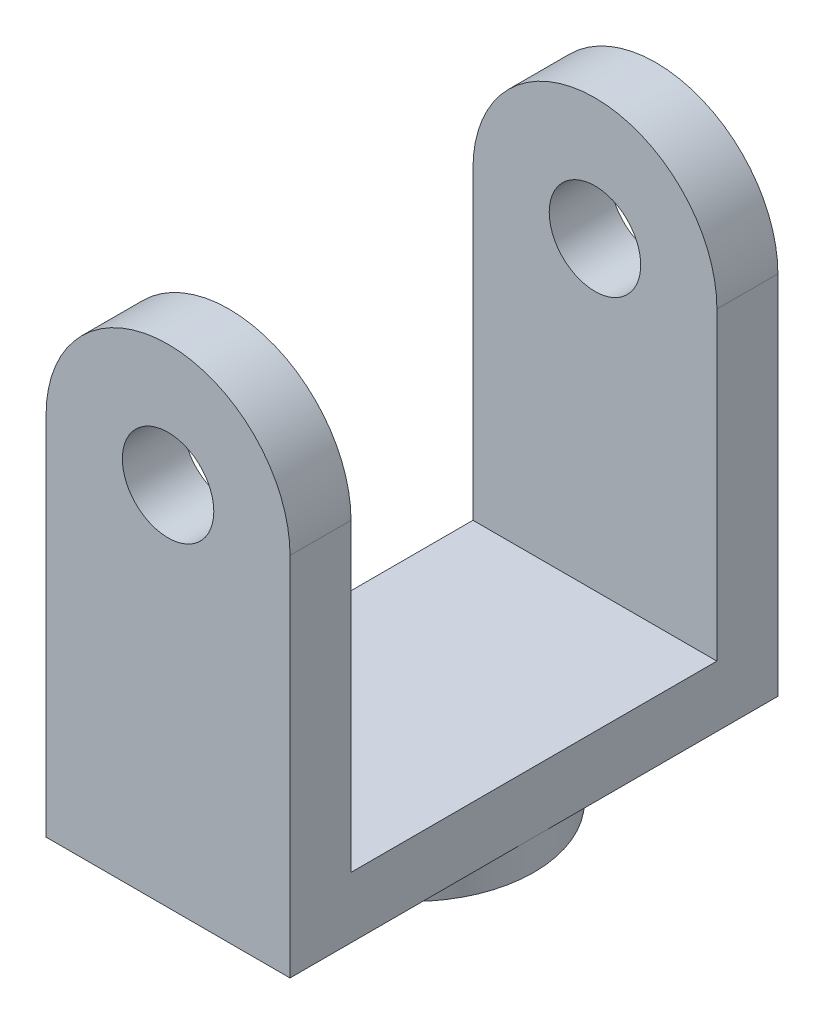
ISO-10303-21;
HEADER;
FILE_DESCRIPTION(('STEP AP214'),'2;1');
FILE_NAME('part.step','',(''),(''),'','','');
FILE_SCHEMA(('AUTOMOTIVE_DESIGN { 1 0 10303 214 1 1 1 1 }'));
ENDSEC;
DATA;
#1=APPLICATION_CONTEXT('core data for automotive mechanical design processes');
#2=APPLICATION_PROTOCOL_DEFINITION('international standard','automotive_design',2000,#1);
#3=PRODUCT_CONTEXT('',#1,'mechanical');
#4=PRODUCT('Part','Part','',(#3));
#5=PRODUCT_RELATED_PRODUCT_CATEGORY('part','',(#4));
#6=PRODUCT_DEFINITION_FORMATION('','',#4);
#7=PRODUCT_DEFINITION_CONTEXT('part definition',#1,'design');
#8=PRODUCT_DEFINITION('design','',#6,#7);
#9=PRODUCT_DEFINITION_SHAPE('','',#8);
#10=(LENGTH_UNIT() NAMED_UNIT(*) SI_UNIT(.MILLI.,.METRE.));
#11=(NAMED_UNIT(*) PLANE_ANGLE_UNIT() SI_UNIT($,.RADIAN.));
#12=(NAMED_UNIT(*) SI_UNIT($,.STERADIAN.) SOLID_ANGLE_UNIT());
#13=UNCERTAINTY_MEASURE_WITH_UNIT(LENGTH_MEASURE(1.E-05),#10,'distance_accuracy_value','');
#14=(GEOMETRIC_REPRESENTATION_CONTEXT(3) GLOBAL_UNCERTAINTY_ASSIGNED_CONTEXT((#13)) GLOBAL_UNIT_ASSIGNED_CONTEXT((#10,
#11,#12)) REPRESENTATION_CONTEXT('',''));
#15=CARTESIAN_POINT('',(0.,0.,0.));
#16=DIRECTION('',(0.,0.,1.));
#17=DIRECTION('',(1.,0.,0.));
#18=AXIS2_PLACEMENT_3D('',#15,#16,#17);
#19=CARTESIAN_POINT('',(-25.4,-76.2,50.8));
#20=DIRECTION('',(0.,1.,0.));
#21=DIRECTION('',(0.,0.,1.));
#22=AXIS2_PLACEMENT_3D('',#19,#20,#21);
#23=PLANE('',#22);
#24=CARTESIAN_POINT('',(0.,-76.2,0.));
#25=DIRECTION('',(0.,-1.,0.));
#26=DIRECTION('',(0.,0.,-1.));
#27=AXIS2_PLACEMENT_3D('',#24,#25,#26);
#28=CIRCLE('',#27,25.4);
#29=CARTESIAN_POINT('',(25.4,-76.2,0.));
#30=VERTEX_POINT('',#29);
#31=CARTESIAN_POINT('',(-25.4,-76.2,0.));
#32=VERTEX_POINT('',#31);
#33=EDGE_CURVE('E44',#30,#32,#28,.T.);
#34=ORIENTED_EDGE('',*,*,#33,.F.);
#35=DIRECTION('',(0.,0.,-1.));
#36=VECTOR('',#35,1.);
#37=CARTESIAN_POINT('',(25.4,-76.2,50.8));
#38=LINE('',#37,#36);
#39=CARTESIAN_POINT('',(25.4,-76.2,50.8));
#40=VERTEX_POINT('',#39);
#41=EDGE_CURVE('E107',#40,#30,#38,.T.);
#42=ORIENTED_EDGE('',*,*,#41,.F.);
#43=DIRECTION('',(1.,0.,0.));
#44=VECTOR('',#43,1.);
#45=CARTESIAN_POINT('',(-25.4,-76.2,50.8));
#46=LINE('',#45,#44);
#47=CARTESIAN_POINT('',(-25.4,-76.2,50.8));
#48=VERTEX_POINT('',#47);
#49=EDGE_CURVE('E210',#48,#40,#46,.T.);
#50=ORIENTED_EDGE('',*,*,#49,.F.);
#51=DIRECTION('',(0.,0.,-1.));
#52=VECTOR('',#51,1.);
#53=CARTESIAN_POINT('',(-25.4,-76.2,50.8));
#54=LINE('',#53,#52);
#55=EDGE_CURVE('E128',#48,#32,#54,.T.);
#56=ORIENTED_EDGE('',*,*,#55,.T.);
#57=EDGE_LOOP('',(#34,#42,#50,#56));
#58=FACE_BOUND('',#57,.T.);
#59=ADVANCED_FACE('F33',(#58),#23,.F.);
#60=CARTESIAN_POINT('',(0.,0.,50.8));
#61=DIRECTION('',(0.,0.,-1.));
#62=DIRECTION('',(-1.,0.,0.));
#63=AXIS2_PLACEMENT_3D('',#60,#61,#62);
#64=CYLINDRICAL_SURFACE('',#63,25.4);
#65=DIRECTION('',(0.,0.,-1.));
#66=VECTOR('',#65,1.);
#67=CARTESIAN_POINT('',(25.4,0.,50.8));
#68=LINE('',#67,#66);
#69=CARTESIAN_POINT('',(25.4,0.,50.8));
#70=VERTEX_POINT('',#69);
#71=CARTESIAN_POINT('',(25.4,0.,38.1));
#72=VERTEX_POINT('',#71);
#73=EDGE_CURVE('E124',#70,#72,#68,.T.);
#74=ORIENTED_EDGE('',*,*,#73,.T.);
#75=CARTESIAN_POINT('',(0.,0.,38.1));
#76=DIRECTION('',(0.,0.,1.));
#77=DIRECTION('',(1.,0.,0.));
#78=AXIS2_PLACEMENT_3D('',#75,#76,#77);
#79=CIRCLE('',#78,25.4);
#80=CARTESIAN_POINT('',(-25.4,0.,38.1));
#81=VERTEX_POINT('',#80);
#82=EDGE_CURVE('E197',#72,#81,#79,.T.);
#83=ORIENTED_EDGE('',*,*,#82,.T.);
#84=DIRECTION('',(0.,0.,-1.));
#85=VECTOR('',#84,1.);
#86=CARTESIAN_POINT('',(-25.4,0.,50.8));
#87=LINE('',#86,#85);
#88=CARTESIAN_POINT('',(-25.4,0.,50.8));
#89=VERTEX_POINT('',#88);
#90=EDGE_CURVE('E42',#89,#81,#87,.T.);
#91=ORIENTED_EDGE('',*,*,#90,.F.);
#92=CARTESIAN_POINT('',(0.,0.,50.8));
#93=DIRECTION('',(0.,0.,1.));
#94=DIRECTION('',(1.,0.,0.));
#95=AXIS2_PLACEMENT_3D('',#92,#93,#94);
#96=CIRCLE('',#95,25.4);
#97=EDGE_CURVE('E206',#70,#89,#96,.T.);
#98=ORIENTED_EDGE('',*,*,#97,.F.);
#99=EDGE_LOOP('',(#74,#83,#91,#98));
#100=FACE_BOUND('',#99,.T.);
#101=ADVANCED_FACE('F148',(#100),#64,.T.);
#102=CARTESIAN_POINT('',(0.,0.,50.8));
#103=DIRECTION('',(0.,0.,-1.));
#104=DIRECTION('',(-1.,0.,0.));
#105=AXIS2_PLACEMENT_3D('',#102,#103,#104);
#106=CYLINDRICAL_SURFACE('',#105,9.525);
#107=CARTESIAN_POINT('',(0.,0.,38.1));
#108=DIRECTION('',(0.,0.,1.));
#109=DIRECTION('',(1.,0.,0.));
#110=AXIS2_PLACEMENT_3D('',#107,#108,#109);
#111=CIRCLE('',#110,9.525);
#112=CARTESIAN_POINT('',(9.525,0.,38.1));
#113=VERTEX_POINT('',#112);
#114=EDGE_CURVE('E37',#113,#113,#111,.T.);
#115=ORIENTED_EDGE('',*,*,#114,.F.);
#116=EDGE_LOOP('',(#115));
#117=FACE_BOUND('',#116,.T.);
#118=CARTESIAN_POINT('',(0.,0.,50.8));
#119=DIRECTION('',(0.,0.,1.));
#120=DIRECTION('',(1.,0.,0.));
#121=AXIS2_PLACEMENT_3D('',#118,#119,#120);
#122=CIRCLE('',#121,9.525);
#123=CARTESIAN_POINT('',(9.525,0.,50.8));
#124=VERTEX_POINT('',#123);
#125=EDGE_CURVE('E200',#124,#124,#122,.T.);
#126=ORIENTED_EDGE('',*,*,#125,.T.);
#127=EDGE_LOOP('',(#126));
#128=FACE_BOUND('',#127,.T.);
#129=ADVANCED_FACE('F153',(#117,#128),#106,.F.);
#130=CARTESIAN_POINT('',(0.,0.,50.8));
#131=DIRECTION('',(0.,0.,1.));
#132=DIRECTION('',(1.,0.,0.));
#133=AXIS2_PLACEMENT_3D('',#130,#131,#132);
#134=PLANE('',#133);
#135=ORIENTED_EDGE('',*,*,#97,.T.);
#136=DIRECTION('',(0.,-1.,0.));
#137=VECTOR('',#136,1.);
#138=CARTESIAN_POINT('',(-25.4,0.,50.8));
#139=LINE('',#138,#137);
#140=EDGE_CURVE('E175',#89,#48,#139,.T.);
#141=ORIENTED_EDGE('',*,*,#140,.T.);
#142=ORIENTED_EDGE('',*,*,#49,.T.);
#143=DIRECTION('',(0.,1.,0.));
#144=VECTOR('',#143,1.);
#145=CARTESIAN_POINT('',(25.4,-76.2,50.8));
#146=LINE('',#145,#144);
#147=EDGE_CURVE('E114',#40,#70,#146,.T.);
#148=ORIENTED_EDGE('',*,*,#147,.T.);
#149=EDGE_LOOP('',(#135,#141,#142,#148));
#150=FACE_BOUND('',#149,.T.);
#151=ORIENTED_EDGE('',*,*,#125,.F.);
#152=EDGE_LOOP('',(#151));
#153=FACE_BOUND('',#152,.T.);
#154=ADVANCED_FACE('F253',(#150,#153),#134,.T.);
#155=CARTESIAN_POINT('',(0.,0.,-50.8));
#156=DIRECTION('',(0.,0.,1.));
#157=DIRECTION('',(1.,0.,0.));
#158=AXIS2_PLACEMENT_3D('',#155,#156,#157);
#159=PLANE('',#158);
#160=CARTESIAN_POINT('',(0.,0.,-50.8));
#161=DIRECTION('',(0.,0.,1.));
#162=DIRECTION('',(1.,0.,0.));
#163=AXIS2_PLACEMENT_3D('',#160,#161,#162);
#164=CIRCLE('',#163,25.4);
#165=CARTESIAN_POINT('',(25.4,0.,-50.8));
#166=VERTEX_POINT('',#165);
#167=CARTESIAN_POINT('',(-25.4,0.,-50.8));
#168=VERTEX_POINT('',#167);
#169=EDGE_CURVE('E203',#166,#168,#164,.T.);
#170=ORIENTED_EDGE('',*,*,#169,.F.);
#171=DIRECTION('',(0.,1.,0.));
#172=VECTOR('',#171,1.);
#173=CARTESIAN_POINT('',(25.4,-76.2,-50.8));
#174=LINE('',#173,#172);
#175=CARTESIAN_POINT('',(25.4,-76.2,-50.8));
#176=VERTEX_POINT('',#175);
#177=EDGE_CURVE('E208',#176,#166,#174,.T.);
#178=ORIENTED_EDGE('',*,*,#177,.F.);
#179=DIRECTION('',(1.,0.,0.));
#180=VECTOR('',#179,1.);
#181=CARTESIAN_POINT('',(-25.4,-76.2,-50.8));
#182=LINE('',#181,#180);
#183=CARTESIAN_POINT('',(-25.4,-76.2,-50.8));
#184=VERTEX_POINT('',#183);
#185=EDGE_CURVE('E122',#184,#176,#182,.T.);
#186=ORIENTED_EDGE('',*,*,#185,.F.);
#187=DIRECTION('',(0.,-1.,0.));
#188=VECTOR('',#187,1.);
#189=CARTESIAN_POINT('',(-25.4,0.,-50.8));
#190=LINE('',#189,#188);
#191=EDGE_CURVE('E216',#168,#184,#190,.T.);
#192=ORIENTED_EDGE('',*,*,#191,.F.);
#193=EDGE_LOOP('',(#170,#178,#186,#192));
#194=FACE_BOUND('',#193,.T.);
#195=CARTESIAN_POINT('',(0.,0.,-50.8));
#196=DIRECTION('',(0.,0.,1.));
#197=DIRECTION('',(1.,0.,0.));
#198=AXIS2_PLACEMENT_3D('',#195,#196,#197);
#199=CIRCLE('',#198,9.525);
#200=CARTESIAN_POINT('',(9.525,0.,-50.8));
#201=VERTEX_POINT('',#200);
#202=EDGE_CURVE('E199',#201,#201,#199,.T.);
#203=ORIENTED_EDGE('',*,*,#202,.T.);
#204=EDGE_LOOP('',(#203));
#205=FACE_BOUND('',#204,.T.);
#206=ADVANCED_FACE('F167',(#194,#205),#159,.F.);
#207=CARTESIAN_POINT('',(-25.4,0.,-38.1));
#208=VERTEX_POINT('',#207);
#209=EDGE_CURVE('E178',#208,#168,#87,.T.);
#210=ORIENTED_EDGE('',*,*,#209,.F.);
#211=CARTESIAN_POINT('',(0.,0.,-38.1));
#212=DIRECTION('',(0.,0.,-1.));
#213=DIRECTION('',(-1.,0.,0.));
#214=AXIS2_PLACEMENT_3D('',#211,#212,#213);
#215=CIRCLE('',#214,25.4);
#216=CARTESIAN_POINT('',(25.4,0.,-38.1));
#217=VERTEX_POINT('',#216);
#218=EDGE_CURVE('E183',#208,#217,#215,.T.);
#219=ORIENTED_EDGE('',*,*,#218,.T.);
#220=EDGE_CURVE('E213',#217,#166,#68,.T.);
#221=ORIENTED_EDGE('',*,*,#220,.T.);
#222=ORIENTED_EDGE('',*,*,#169,.T.);
#223=EDGE_LOOP('',(#210,#219,#221,#222));
#224=FACE_BOUND('',#223,.T.);
#225=ADVANCED_FACE('F35',(#224),#64,.T.);
#226=CARTESIAN_POINT('',(-25.4,0.,50.8));
#227=DIRECTION('',(1.,0.,0.));
#228=DIRECTION('',(0.,1.,0.));
#229=AXIS2_PLACEMENT_3D('',#226,#227,#228);
#230=PLANE('',#229);
#231=ORIENTED_EDGE('',*,*,#90,.T.);
#232=DIRECTION('',(0.,-1.,0.));
#233=VECTOR('',#232,1.);
#234=CARTESIAN_POINT('',(-25.4,-63.5,38.1));
#235=LINE('',#234,#233);
#236=CARTESIAN_POINT('',(-25.4,-63.5,38.1));
#237=VERTEX_POINT('',#236);
#238=EDGE_CURVE('E174',#81,#237,#235,.T.);
#239=ORIENTED_EDGE('',*,*,#238,.T.);
#240=DIRECTION('',(0.,0.,-1.));
#241=VECTOR('',#240,1.);
#242=CARTESIAN_POINT('',(-25.4,-63.5,38.1));
#243=LINE('',#242,#241);
#244=CARTESIAN_POINT('',(-25.4,-63.5,-38.1));
#245=VERTEX_POINT('',#244);
#246=EDGE_CURVE('E230',#237,#245,#243,.T.);
#247=ORIENTED_EDGE('',*,*,#246,.T.);
#248=DIRECTION('',(0.,1.,0.));
#249=VECTOR('',#248,1.);
#250=CARTESIAN_POINT('',(-25.4,-63.5,-38.1));
#251=LINE('',#250,#249);
#252=EDGE_CURVE('E192',#245,#208,#251,.T.);
#253=ORIENTED_EDGE('',*,*,#252,.T.);
#254=ORIENTED_EDGE('',*,*,#209,.T.);
#255=ORIENTED_EDGE('',*,*,#191,.T.);
#256=EDGE_CURVE('E118',#32,#184,#54,.T.);
#257=ORIENTED_EDGE('',*,*,#256,.F.);
#258=ORIENTED_EDGE('',*,*,#55,.F.);
#259=ORIENTED_EDGE('',*,*,#140,.F.);
#260=EDGE_LOOP('',(#231,#239,#247,#253,#254,#255,#257,#258,#259));
#261=FACE_BOUND('',#260,.T.);
#262=ADVANCED_FACE('F157',(#261),#230,.F.);
#263=EDGE_CURVE('E11',#32,#30,#28,.T.);
#264=ORIENTED_EDGE('',*,*,#263,.F.);
#265=ORIENTED_EDGE('',*,*,#256,.T.);
#266=ORIENTED_EDGE('',*,*,#185,.T.);
#267=EDGE_CURVE('E111',#30,#176,#38,.T.);
#268=ORIENTED_EDGE('',*,*,#267,.F.);
#269=EDGE_LOOP('',(#264,#265,#266,#268));
#270=FACE_BOUND('',#269,.T.);
#271=ADVANCED_FACE('F120',(#270),#23,.F.);
#272=CARTESIAN_POINT('',(25.4,-76.2,50.8));
#273=DIRECTION('',(-1.,0.,0.));
#274=DIRECTION('',(0.,-1.,0.));
#275=AXIS2_PLACEMENT_3D('',#272,#273,#274);
#276=PLANE('',#275);
#277=DIRECTION('',(0.,0.,-1.));
#278=VECTOR('',#277,1.);
#279=CARTESIAN_POINT('',(25.4,-63.5,38.1));
#280=LINE('',#279,#278);
#281=CARTESIAN_POINT('',(25.4,-63.5,38.1));
#282=VERTEX_POINT('',#281);
#283=CARTESIAN_POINT('',(25.4,-63.5,-38.1));
#284=VERTEX_POINT('',#283);
#285=EDGE_CURVE('E235',#282,#284,#280,.T.);
#286=ORIENTED_EDGE('',*,*,#285,.F.);
#287=DIRECTION('',(0.,-1.,0.));
#288=VECTOR('',#287,1.);
#289=CARTESIAN_POINT('',(25.4,-63.5,38.1));
#290=LINE('',#289,#288);
#291=EDGE_CURVE('E237',#72,#282,#290,.T.);
#292=ORIENTED_EDGE('',*,*,#291,.F.);
#293=ORIENTED_EDGE('',*,*,#73,.F.);
#294=ORIENTED_EDGE('',*,*,#147,.F.);
#295=ORIENTED_EDGE('',*,*,#41,.T.);
#296=ORIENTED_EDGE('',*,*,#267,.T.);
#297=ORIENTED_EDGE('',*,*,#177,.T.);
#298=ORIENTED_EDGE('',*,*,#220,.F.);
#299=DIRECTION('',(0.,1.,0.));
#300=VECTOR('',#299,1.);
#301=CARTESIAN_POINT('',(25.4,-63.5,-38.1));
#302=LINE('',#301,#300);
#303=EDGE_CURVE('E231',#284,#217,#302,.T.);
#304=ORIENTED_EDGE('',*,*,#303,.F.);
#305=EDGE_LOOP('',(#286,#292,#293,#294,#295,#296,#297,#298,#304));
#306=FACE_BOUND('',#305,.T.);
#307=ADVANCED_FACE('F109',(#306),#276,.F.);
#308=CARTESIAN_POINT('',(0.,0.,-38.1));
#309=DIRECTION('',(0.,0.,-1.));
#310=DIRECTION('',(-1.,0.,0.));
#311=AXIS2_PLACEMENT_3D('',#308,#309,#310);
#312=CIRCLE('',#311,9.525);
#313=CARTESIAN_POINT('',(-9.525,0.,-38.1));
#314=VERTEX_POINT('',#313);
#315=EDGE_CURVE('E181',#314,#314,#312,.T.);
#316=ORIENTED_EDGE('',*,*,#315,.F.);
#317=EDGE_LOOP('',(#316));
#318=FACE_BOUND('',#317,.T.);
#319=ORIENTED_EDGE('',*,*,#202,.F.);
#320=EDGE_LOOP('',(#319));
#321=FACE_BOUND('',#320,.T.);
#322=ADVANCED_FACE('F162',(#318,#321),#106,.F.);
#323=CARTESIAN_POINT('',(-25.4,-63.5,38.1));
#324=DIRECTION('',(0.,0.,1.));
#325=DIRECTION('',(1.,0.,0.));
#326=AXIS2_PLACEMENT_3D('',#323,#324,#325);
#327=PLANE('',#326);
#328=ORIENTED_EDGE('',*,*,#114,.T.);
#329=EDGE_LOOP('',(#328));
#330=FACE_BOUND('',#329,.T.);
#331=ORIENTED_EDGE('',*,*,#291,.T.);
#332=DIRECTION('',(1.,0.,0.));
#333=VECTOR('',#332,1.);
#334=CARTESIAN_POINT('',(-25.4,-63.5,38.1));
#335=LINE('',#334,#333);
#336=EDGE_CURVE('E57',#237,#282,#335,.T.);
#337=ORIENTED_EDGE('',*,*,#336,.F.);
#338=ORIENTED_EDGE('',*,*,#238,.F.);
#339=ORIENTED_EDGE('',*,*,#82,.F.);
#340=EDGE_LOOP('',(#331,#337,#338,#339));
#341=FACE_BOUND('',#340,.T.);
#342=ADVANCED_FACE('F242',(#330,#341),#327,.F.);
#343=CARTESIAN_POINT('',(-25.4,-63.5,-38.1));
#344=DIRECTION('',(0.,0.,-1.));
#345=DIRECTION('',(-1.,0.,0.));
#346=AXIS2_PLACEMENT_3D('',#343,#344,#345);
#347=PLANE('',#346);
#348=ORIENTED_EDGE('',*,*,#315,.T.);
#349=EDGE_LOOP('',(#348));
#350=FACE_BOUND('',#349,.T.);
#351=ORIENTED_EDGE('',*,*,#252,.F.);
#352=DIRECTION('',(1.,0.,0.));
#353=VECTOR('',#352,1.);
#354=CARTESIAN_POINT('',(-25.4,-63.5,-38.1));
#355=LINE('',#354,#353);
#356=EDGE_CURVE('E184',#245,#284,#355,.T.);
#357=ORIENTED_EDGE('',*,*,#356,.T.);
#358=ORIENTED_EDGE('',*,*,#303,.T.);
#359=ORIENTED_EDGE('',*,*,#218,.F.);
#360=EDGE_LOOP('',(#351,#357,#358,#359));
#361=FACE_BOUND('',#360,.T.);
#362=ADVANCED_FACE('F143',(#350,#361),#347,.F.);
#363=CARTESIAN_POINT('',(-25.4,-63.5,38.1));
#364=DIRECTION('',(0.,-1.,0.));
#365=DIRECTION('',(0.,0.,-1.));
#366=AXIS2_PLACEMENT_3D('',#363,#364,#365);
#367=PLANE('',#366);
#368=ORIENTED_EDGE('',*,*,#356,.F.);
#369=ORIENTED_EDGE('',*,*,#246,.F.);
#370=ORIENTED_EDGE('',*,*,#336,.T.);
#371=ORIENTED_EDGE('',*,*,#285,.T.);
#372=EDGE_LOOP('',(#368,#369,#370,#371));
#373=FACE_BOUND('',#372,.T.);
#374=ADVANCED_FACE('F134',(#373),#367,.F.);
#375=CARTESIAN_POINT('',(0.,-82.55,0.));
#376=DIRECTION('',(0.,1.,0.));
#377=DIRECTION('',(0.,0.,1.));
#378=AXIS2_PLACEMENT_3D('',#375,#376,#377);
#379=CYLINDRICAL_SURFACE('',#378,25.4);
#380=CARTESIAN_POINT('',(0.,-82.55,0.));
#381=DIRECTION('',(0.,-1.,0.));
#382=DIRECTION('',(0.,0.,-1.));
#383=AXIS2_PLACEMENT_3D('',#380,#381,#382);
#384=CIRCLE('',#383,25.4);
#385=CARTESIAN_POINT('',(0.,-82.55,-25.4));
#386=VERTEX_POINT('',#385);
#387=EDGE_CURVE('E130',#386,#386,#384,.T.);
#388=ORIENTED_EDGE('',*,*,#387,.F.);
#389=EDGE_LOOP('',(#388));
#390=FACE_BOUND('',#389,.T.);
#391=ORIENTED_EDGE('',*,*,#33,.T.);
#392=ORIENTED_EDGE('',*,*,#263,.T.);
#393=EDGE_LOOP('',(#391,#392));
#394=FACE_BOUND('',#393,.T.);
#395=ADVANCED_FACE('F131',(#390,#394),#379,.T.);
#396=CARTESIAN_POINT('',(0.,-82.55,0.));
#397=DIRECTION('',(0.,-1.,0.));
#398=DIRECTION('',(0.,0.,-1.));
#399=AXIS2_PLACEMENT_3D('',#396,#397,#398);
#400=PLANE('',#399);
#401=ORIENTED_EDGE('',*,*,#387,.T.);
#402=EDGE_LOOP('',(#401));
#403=FACE_BOUND('',#402,.T.);
#404=ADVANCED_FACE('F133',(#403),#400,.T.);
#405=CLOSED_SHELL('',(#59,#101,#129,#154,#206,#225,#262,#271,#307,#322,#342,#362,#374,#395,#404));
#406=MANIFOLD_SOLID_BREP('B2',#405);
#407=ADVANCED_BREP_SHAPE_REPRESENTATION('',(#18,#406),#14);
#408=SHAPE_DEFINITION_REPRESENTATION(#9,#407);
ENDSEC;
END-ISO-10303-21;
